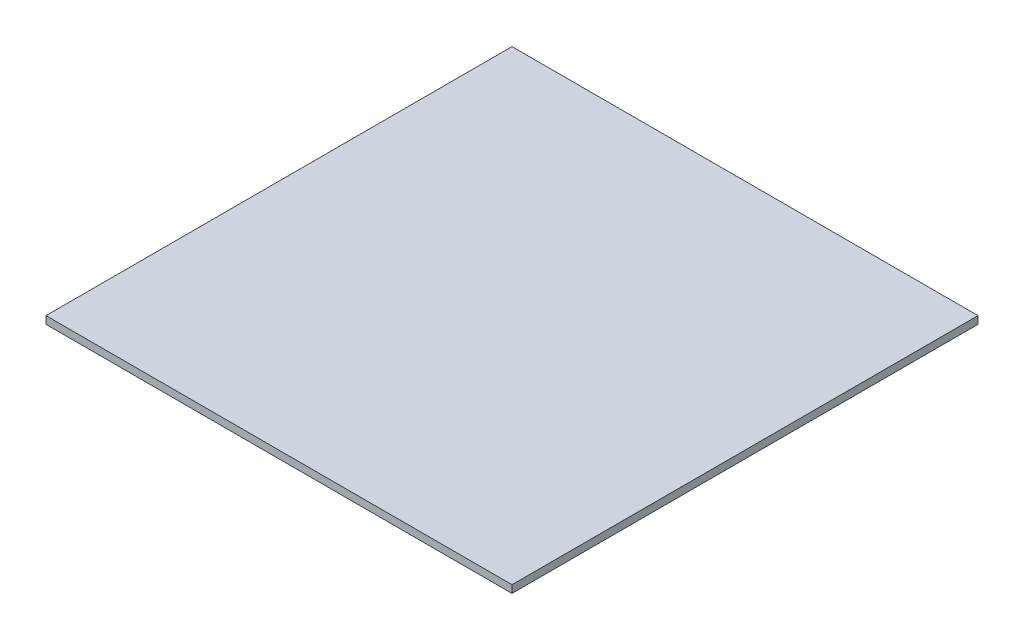
ISO-10303-21;
HEADER;
FILE_DESCRIPTION(('STEP AP214'),'2;1');
FILE_NAME('part.step','',(''),(''),'','','');
FILE_SCHEMA(('AUTOMOTIVE_DESIGN { 1 0 10303 214 1 1 1 1 }'));
ENDSEC;
DATA;
#1=APPLICATION_CONTEXT('core data for automotive mechanical design processes');
#2=APPLICATION_PROTOCOL_DEFINITION('international standard','automotive_design',2000,#1);
#3=PRODUCT_CONTEXT('',#1,'mechanical');
#4=PRODUCT('Part','Part','',(#3));
#5=PRODUCT_RELATED_PRODUCT_CATEGORY('part','',(#4));
#6=PRODUCT_DEFINITION_FORMATION('','',#4);
#7=PRODUCT_DEFINITION_CONTEXT('part definition',#1,'design');
#8=PRODUCT_DEFINITION('design','',#6,#7);
#9=PRODUCT_DEFINITION_SHAPE('','',#8);
#10=(LENGTH_UNIT() NAMED_UNIT(*) SI_UNIT(.MILLI.,.METRE.));
#11=(NAMED_UNIT(*) PLANE_ANGLE_UNIT() SI_UNIT($,.RADIAN.));
#12=(NAMED_UNIT(*) SI_UNIT($,.STERADIAN.) SOLID_ANGLE_UNIT());
#13=UNCERTAINTY_MEASURE_WITH_UNIT(LENGTH_MEASURE(1.E-05),#10,'distance_accuracy_value','');
#14=(GEOMETRIC_REPRESENTATION_CONTEXT(3) GLOBAL_UNCERTAINTY_ASSIGNED_CONTEXT((#13)) GLOBAL_UNIT_ASSIGNED_CONTEXT((#10,
#11,#12)) REPRESENTATION_CONTEXT('',''));
#15=CARTESIAN_POINT('',(0.,0.,0.));
#16=DIRECTION('',(0.,0.,1.));
#17=DIRECTION('',(1.,0.,0.));
#18=AXIS2_PLACEMENT_3D('',#15,#16,#17);
#19=CARTESIAN_POINT('',(50.,1.6256,-50.));
#20=DIRECTION('',(-1.,0.,0.));
#21=DIRECTION('',(0.,0.,1.));
#22=AXIS2_PLACEMENT_3D('',#19,#20,#21);
#23=PLANE('',#22);
#24=DIRECTION('',(0.,0.,-1.));
#25=VECTOR('',#24,1.);
#26=CARTESIAN_POINT('',(50.,0.,-50.));
#27=LINE('',#26,#25);
#28=CARTESIAN_POINT('',(50.,0.,50.));
#29=VERTEX_POINT('',#28);
#30=CARTESIAN_POINT('',(50.,0.,-50.));
#31=VERTEX_POINT('',#30);
#32=EDGE_CURVE('E115',#29,#31,#27,.T.);
#33=ORIENTED_EDGE('',*,*,#32,.T.);
#34=DIRECTION('',(0.,-1.,0.));
#35=VECTOR('',#34,1.);
#36=CARTESIAN_POINT('',(50.,1.6256,-50.));
#37=LINE('',#36,#35);
#38=CARTESIAN_POINT('',(50.,1.6256,-50.));
#39=VERTEX_POINT('',#38);
#40=EDGE_CURVE('E11',#39,#31,#37,.T.);
#41=ORIENTED_EDGE('',*,*,#40,.F.);
#42=DIRECTION('',(0.,0.,-1.));
#43=VECTOR('',#42,1.);
#44=CARTESIAN_POINT('',(50.,1.6256,-50.));
#45=LINE('',#44,#43);
#46=CARTESIAN_POINT('',(50.,1.6256,50.));
#47=VERTEX_POINT('',#46);
#48=EDGE_CURVE('E98',#47,#39,#45,.T.);
#49=ORIENTED_EDGE('',*,*,#48,.F.);
#50=DIRECTION('',(0.,-1.,0.));
#51=VECTOR('',#50,1.);
#52=CARTESIAN_POINT('',(50.,1.6256,50.));
#53=LINE('',#52,#51);
#54=EDGE_CURVE('E111',#47,#29,#53,.T.);
#55=ORIENTED_EDGE('',*,*,#54,.T.);
#56=EDGE_LOOP('',(#33,#41,#49,#55));
#57=FACE_BOUND('',#56,.T.);
#58=ADVANCED_FACE('F40',(#57),#23,.F.);
#59=CARTESIAN_POINT('',(-50.,1.6256,-50.));
#60=DIRECTION('',(0.,0.,1.));
#61=DIRECTION('',(1.,0.,0.));
#62=AXIS2_PLACEMENT_3D('',#59,#60,#61);
#63=PLANE('',#62);
#64=DIRECTION('',(-1.,0.,0.));
#65=VECTOR('',#64,1.);
#66=CARTESIAN_POINT('',(-50.,0.,-50.));
#67=LINE('',#66,#65);
#68=CARTESIAN_POINT('',(-50.,0.,-50.));
#69=VERTEX_POINT('',#68);
#70=EDGE_CURVE('E103',#31,#69,#67,.T.);
#71=ORIENTED_EDGE('',*,*,#70,.T.);
#72=DIRECTION('',(0.,-1.,0.));
#73=VECTOR('',#72,1.);
#74=CARTESIAN_POINT('',(-50.,1.6256,-50.));
#75=LINE('',#74,#73);
#76=CARTESIAN_POINT('',(-50.,1.6256,-50.));
#77=VERTEX_POINT('',#76);
#78=EDGE_CURVE('E49',#77,#69,#75,.T.);
#79=ORIENTED_EDGE('',*,*,#78,.F.);
#80=DIRECTION('',(-1.,0.,0.));
#81=VECTOR('',#80,1.);
#82=CARTESIAN_POINT('',(-50.,1.6256,-50.));
#83=LINE('',#82,#81);
#84=EDGE_CURVE('E92',#39,#77,#83,.T.);
#85=ORIENTED_EDGE('',*,*,#84,.F.);
#86=ORIENTED_EDGE('',*,*,#40,.T.);
#87=EDGE_LOOP('',(#71,#79,#85,#86));
#88=FACE_BOUND('',#87,.T.);
#89=ADVANCED_FACE('F102',(#88),#63,.F.);
#90=CARTESIAN_POINT('',(-50.,1.6256,-50.));
#91=DIRECTION('',(1.,0.,0.));
#92=DIRECTION('',(0.,0.,-1.));
#93=AXIS2_PLACEMENT_3D('',#90,#91,#92);
#94=PLANE('',#93);
#95=DIRECTION('',(0.,0.,1.));
#96=VECTOR('',#95,1.);
#97=CARTESIAN_POINT('',(-50.,0.,-50.));
#98=LINE('',#97,#96);
#99=CARTESIAN_POINT('',(-50.,0.,50.));
#100=VERTEX_POINT('',#99);
#101=EDGE_CURVE('E79',#69,#100,#98,.T.);
#102=ORIENTED_EDGE('',*,*,#101,.T.);
#103=DIRECTION('',(0.,-1.,0.));
#104=VECTOR('',#103,1.);
#105=CARTESIAN_POINT('',(-50.,1.6256,50.));
#106=LINE('',#105,#104);
#107=CARTESIAN_POINT('',(-50.,1.6256,50.));
#108=VERTEX_POINT('',#107);
#109=EDGE_CURVE('E105',#108,#100,#106,.T.);
#110=ORIENTED_EDGE('',*,*,#109,.F.);
#111=DIRECTION('',(0.,0.,1.));
#112=VECTOR('',#111,1.);
#113=CARTESIAN_POINT('',(-50.,1.6256,-50.));
#114=LINE('',#113,#112);
#115=EDGE_CURVE('E96',#77,#108,#114,.T.);
#116=ORIENTED_EDGE('',*,*,#115,.F.);
#117=ORIENTED_EDGE('',*,*,#78,.T.);
#118=EDGE_LOOP('',(#102,#110,#116,#117));
#119=FACE_BOUND('',#118,.T.);
#120=ADVANCED_FACE('F106',(#119),#94,.F.);
#121=CARTESIAN_POINT('',(-50.,1.6256,50.));
#122=DIRECTION('',(0.,0.,-1.));
#123=DIRECTION('',(-1.,0.,0.));
#124=AXIS2_PLACEMENT_3D('',#121,#122,#123);
#125=PLANE('',#124);
#126=DIRECTION('',(1.,0.,0.));
#127=VECTOR('',#126,1.);
#128=CARTESIAN_POINT('',(-50.,0.,50.));
#129=LINE('',#128,#127);
#130=EDGE_CURVE('E85',#100,#29,#129,.T.);
#131=ORIENTED_EDGE('',*,*,#130,.T.);
#132=ORIENTED_EDGE('',*,*,#54,.F.);
#133=DIRECTION('',(1.,0.,0.));
#134=VECTOR('',#133,1.);
#135=CARTESIAN_POINT('',(-50.,1.6256,50.));
#136=LINE('',#135,#134);
#137=EDGE_CURVE('E57',#108,#47,#136,.T.);
#138=ORIENTED_EDGE('',*,*,#137,.F.);
#139=ORIENTED_EDGE('',*,*,#109,.T.);
#140=EDGE_LOOP('',(#131,#132,#138,#139));
#141=FACE_BOUND('',#140,.T.);
#142=ADVANCED_FACE('F126',(#141),#125,.F.);
#143=CARTESIAN_POINT('',(0.,1.6256,0.));
#144=DIRECTION('',(0.,1.,0.));
#145=DIRECTION('',(0.,0.,1.));
#146=AXIS2_PLACEMENT_3D('',#143,#144,#145);
#147=PLANE('',#146);
#148=ORIENTED_EDGE('',*,*,#48,.T.);
#149=ORIENTED_EDGE('',*,*,#84,.T.);
#150=ORIENTED_EDGE('',*,*,#115,.T.);
#151=ORIENTED_EDGE('',*,*,#137,.T.);
#152=EDGE_LOOP('',(#148,#149,#150,#151));
#153=FACE_BOUND('',#152,.T.);
#154=ADVANCED_FACE('F94',(#153),#147,.T.);
#155=CARTESIAN_POINT('',(0.,0.,0.));
#156=DIRECTION('',(0.,1.,0.));
#157=DIRECTION('',(0.,0.,1.));
#158=AXIS2_PLACEMENT_3D('',#155,#156,#157);
#159=PLANE('',#158);
#160=ORIENTED_EDGE('',*,*,#32,.F.);
#161=ORIENTED_EDGE('',*,*,#130,.F.);
#162=ORIENTED_EDGE('',*,*,#101,.F.);
#163=ORIENTED_EDGE('',*,*,#70,.F.);
#164=EDGE_LOOP('',(#160,#161,#162,#163));
#165=FACE_BOUND('',#164,.T.);
#166=ADVANCED_FACE('F129',(#165),#159,.F.);
#167=CLOSED_SHELL('',(#58,#89,#120,#142,#154,#166));
#168=MANIFOLD_SOLID_BREP('B2',#167);
#169=ADVANCED_BREP_SHAPE_REPRESENTATION('',(#18,#168),#14);
#170=SHAPE_DEFINITION_REPRESENTATION(#9,#169);
ENDSEC;
END-ISO-10303-21;
